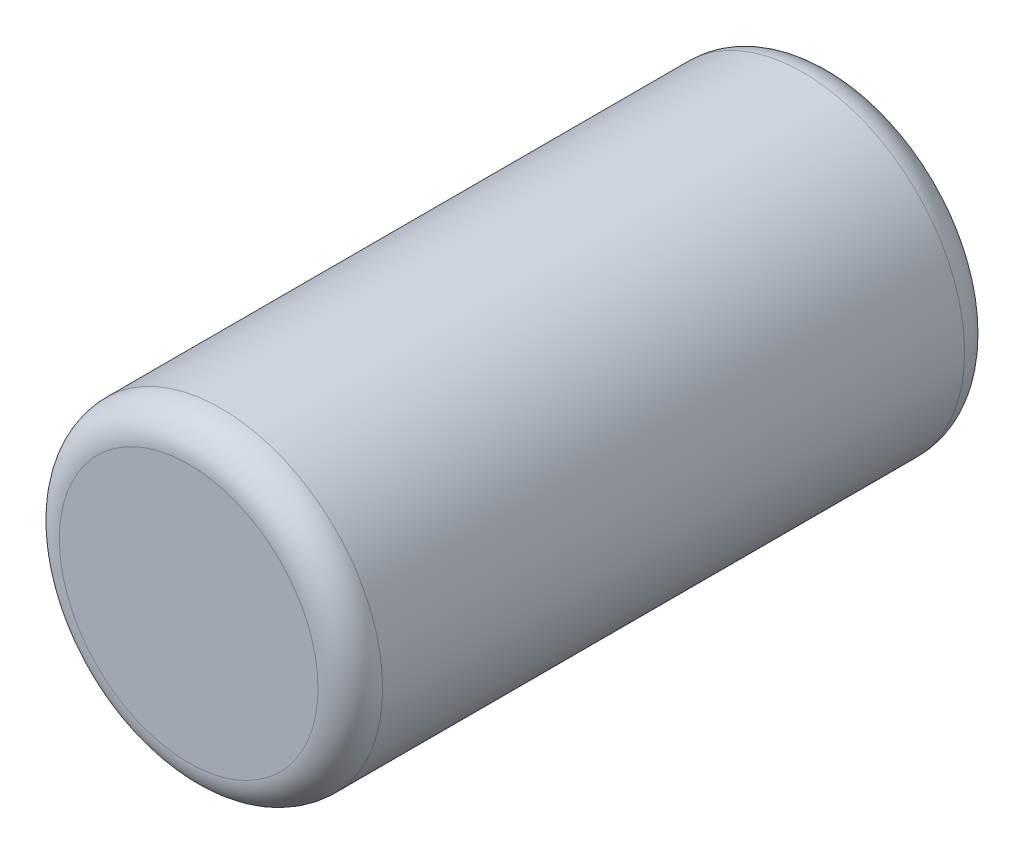
ISO-10303-21;
HEADER;
FILE_DESCRIPTION(('STEP AP214'),'2;1');
FILE_NAME('part.step','',(''),(''),'','','');
FILE_SCHEMA(('AUTOMOTIVE_DESIGN { 1 0 10303 214 1 1 1 1 }'));
ENDSEC;
DATA;
#1=APPLICATION_CONTEXT('core data for automotive mechanical design processes');
#2=APPLICATION_PROTOCOL_DEFINITION('international standard','automotive_design',2000,#1);
#3=PRODUCT_CONTEXT('',#1,'mechanical');
#4=PRODUCT('Part','Part','',(#3));
#5=PRODUCT_RELATED_PRODUCT_CATEGORY('part','',(#4));
#6=PRODUCT_DEFINITION_FORMATION('','',#4);
#7=PRODUCT_DEFINITION_CONTEXT('part definition',#1,'design');
#8=PRODUCT_DEFINITION('design','',#6,#7);
#9=PRODUCT_DEFINITION_SHAPE('','',#8);
#10=(LENGTH_UNIT() NAMED_UNIT(*) SI_UNIT(.MILLI.,.METRE.));
#11=(NAMED_UNIT(*) PLANE_ANGLE_UNIT() SI_UNIT($,.RADIAN.));
#12=(NAMED_UNIT(*) SI_UNIT($,.STERADIAN.) SOLID_ANGLE_UNIT());
#13=UNCERTAINTY_MEASURE_WITH_UNIT(LENGTH_MEASURE(1.E-05),#10,'distance_accuracy_value','');
#14=(GEOMETRIC_REPRESENTATION_CONTEXT(3) GLOBAL_UNCERTAINTY_ASSIGNED_CONTEXT((#13)) GLOBAL_UNIT_ASSIGNED_CONTEXT((#10,
#11,#12)) REPRESENTATION_CONTEXT('',''));
#15=CARTESIAN_POINT('',(0.,0.,0.));
#16=DIRECTION('',(0.,0.,1.));
#17=DIRECTION('',(1.,0.,0.));
#18=AXIS2_PLACEMENT_3D('',#15,#16,#17);
#19=CARTESIAN_POINT('',(0.,0.,2.54));
#20=DIRECTION('',(0.,0.,-1.));
#21=DIRECTION('',(-1.,0.,0.));
#22=AXIS2_PLACEMENT_3D('',#19,#20,#21);
#23=CYLINDRICAL_SURFACE('',#22,1.27);
#24=CARTESIAN_POINT('',(0.,0.,-2.286));
#25=DIRECTION('',(0.,0.,1.));
#26=DIRECTION('',(1.,0.,0.));
#27=AXIS2_PLACEMENT_3D('',#24,#25,#26);
#28=CIRCLE('',#27,1.27);
#29=CARTESIAN_POINT('',(1.27,0.,-2.286));
#30=VERTEX_POINT('',#29);
#31=EDGE_CURVE('E52',#30,#30,#28,.T.);
#32=ORIENTED_EDGE('',*,*,#31,.T.);
#33=EDGE_LOOP('',(#32));
#34=FACE_BOUND('',#33,.T.);
#35=CARTESIAN_POINT('',(0.,0.,2.286));
#36=DIRECTION('',(0.,0.,1.));
#37=DIRECTION('',(1.,0.,0.));
#38=AXIS2_PLACEMENT_3D('',#35,#36,#37);
#39=CIRCLE('',#38,1.27);
#40=CARTESIAN_POINT('',(1.27,0.,2.286));
#41=VERTEX_POINT('',#40);
#42=EDGE_CURVE('E57',#41,#41,#39,.F.);
#43=ORIENTED_EDGE('',*,*,#42,.T.);
#44=EDGE_LOOP('',(#43));
#45=FACE_BOUND('',#44,.T.);
#46=ADVANCED_FACE('F39',(#34,#45),#23,.T.);
#47=CARTESIAN_POINT('',(0.,0.,2.54));
#48=DIRECTION('',(0.,0.,1.));
#49=DIRECTION('',(1.,0.,0.));
#50=AXIS2_PLACEMENT_3D('',#47,#48,#49);
#51=PLANE('',#50);
#52=CARTESIAN_POINT('',(0.,0.,2.54));
#53=DIRECTION('',(0.,0.,1.));
#54=DIRECTION('',(1.,0.,0.));
#55=AXIS2_PLACEMENT_3D('',#52,#53,#54);
#56=CIRCLE('',#55,1.016);
#57=CARTESIAN_POINT('',(1.016,0.,2.54));
#58=VERTEX_POINT('',#57);
#59=EDGE_CURVE('E10',#58,#58,#56,.T.);
#60=ORIENTED_EDGE('',*,*,#59,.T.);
#61=EDGE_LOOP('',(#60));
#62=FACE_BOUND('',#61,.T.);
#63=ADVANCED_FACE('F74',(#62),#51,.T.);
#64=CARTESIAN_POINT('',(0.,0.,-2.54));
#65=DIRECTION('',(0.,0.,1.));
#66=DIRECTION('',(1.,0.,0.));
#67=AXIS2_PLACEMENT_3D('',#64,#65,#66);
#68=PLANE('',#67);
#69=CARTESIAN_POINT('',(0.,0.,-2.54));
#70=DIRECTION('',(0.,0.,1.));
#71=DIRECTION('',(1.,0.,0.));
#72=AXIS2_PLACEMENT_3D('',#69,#70,#71);
#73=CIRCLE('',#72,1.016);
#74=CARTESIAN_POINT('',(1.016,0.,-2.54));
#75=VERTEX_POINT('',#74);
#76=EDGE_CURVE('E47',#75,#75,#73,.F.);
#77=ORIENTED_EDGE('',*,*,#76,.T.);
#78=EDGE_LOOP('',(#77));
#79=FACE_BOUND('',#78,.T.);
#80=ADVANCED_FACE('F71',(#79),#68,.F.);
#81=CARTESIAN_POINT('',(0.,0.,-2.286));
#82=DIRECTION('',(0.,0.,1.));
#83=DIRECTION('',(1.,0.,0.));
#84=AXIS2_PLACEMENT_3D('',#81,#82,#83);
#85=TOROIDAL_SURFACE('',#84,1.016,0.254);
#86=ORIENTED_EDGE('',*,*,#76,.F.);
#87=EDGE_LOOP('',(#86));
#88=FACE_BOUND('',#87,.T.);
#89=ORIENTED_EDGE('',*,*,#31,.F.);
#90=EDGE_LOOP('',(#89));
#91=FACE_BOUND('',#90,.T.);
#92=ADVANCED_FACE('F67',(#88,#91),#85,.T.);
#93=CARTESIAN_POINT('',(0.,0.,2.286));
#94=DIRECTION('',(0.,0.,1.));
#95=DIRECTION('',(1.,0.,0.));
#96=AXIS2_PLACEMENT_3D('',#93,#94,#95);
#97=TOROIDAL_SURFACE('',#96,1.016,0.254);
#98=ORIENTED_EDGE('',*,*,#42,.F.);
#99=EDGE_LOOP('',(#98));
#100=FACE_BOUND('',#99,.T.);
#101=ORIENTED_EDGE('',*,*,#59,.F.);
#102=EDGE_LOOP('',(#101));
#103=FACE_BOUND('',#102,.T.);
#104=ADVANCED_FACE('F41',(#100,#103),#97,.T.);
#105=CLOSED_SHELL('',(#46,#63,#80,#92,#104));
#106=MANIFOLD_SOLID_BREP('B2',#105);
#107=ADVANCED_BREP_SHAPE_REPRESENTATION('',(#18,#106),#14);
#108=SHAPE_DEFINITION_REPRESENTATION(#9,#107);
ENDSEC;
END-ISO-10303-21;
